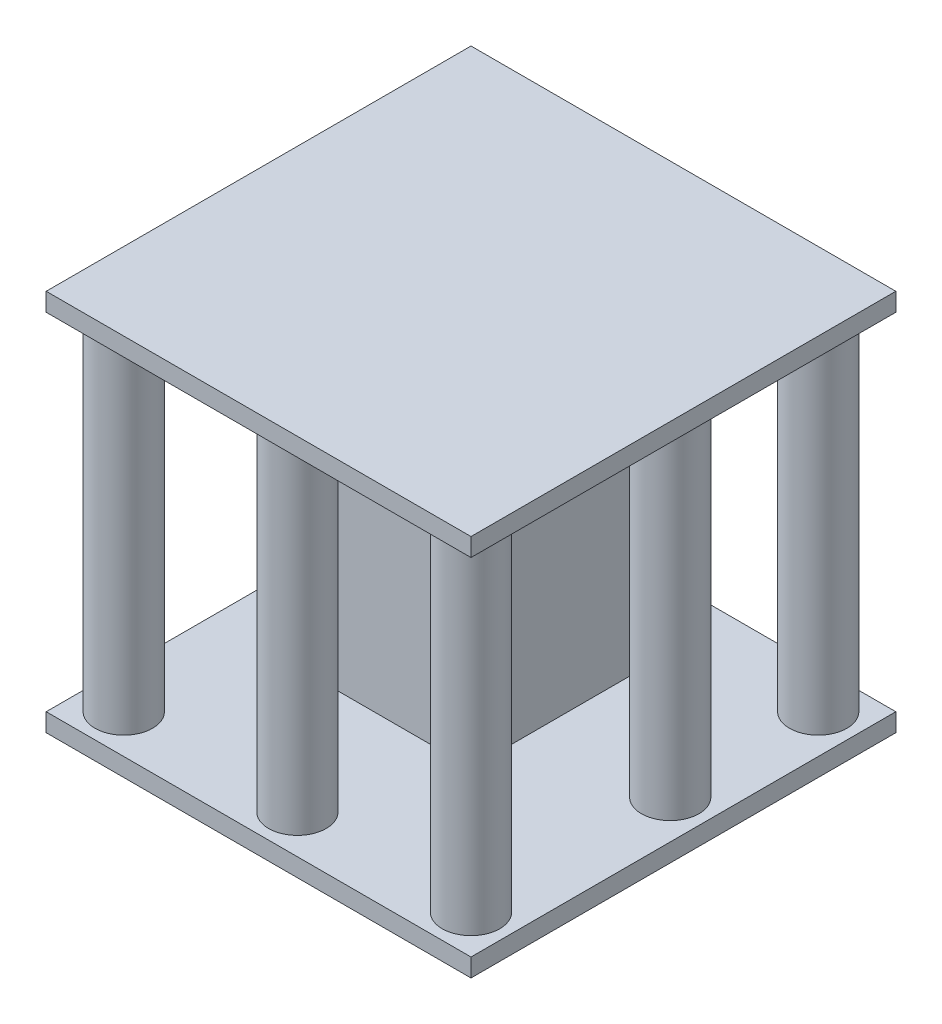
ISO-10303-21;
HEADER;
FILE_DESCRIPTION(('STEP AP214'),'2;1');
FILE_NAME('part.step','',(''),(''),'','','');
FILE_SCHEMA(('AUTOMOTIVE_DESIGN { 1 0 10303 214 1 1 1 1 }'));
ENDSEC;
DATA;
#1=APPLICATION_CONTEXT('core data for automotive mechanical design processes');
#2=APPLICATION_PROTOCOL_DEFINITION('international standard','automotive_design',2000,#1);
#3=PRODUCT_CONTEXT('',#1,'mechanical');
#4=PRODUCT('Part','Part','',(#3));
#5=PRODUCT_RELATED_PRODUCT_CATEGORY('part','',(#4));
#6=PRODUCT_DEFINITION_FORMATION('','',#4);
#7=PRODUCT_DEFINITION_CONTEXT('part definition',#1,'design');
#8=PRODUCT_DEFINITION('design','',#6,#7);
#9=PRODUCT_DEFINITION_SHAPE('','',#8);
#10=(LENGTH_UNIT() NAMED_UNIT(*) SI_UNIT(.MILLI.,.METRE.));
#11=(NAMED_UNIT(*) PLANE_ANGLE_UNIT() SI_UNIT($,.RADIAN.));
#12=(NAMED_UNIT(*) SI_UNIT($,.STERADIAN.) SOLID_ANGLE_UNIT());
#13=UNCERTAINTY_MEASURE_WITH_UNIT(LENGTH_MEASURE(1.E-05),#10,'distance_accuracy_value','');
#14=(GEOMETRIC_REPRESENTATION_CONTEXT(3) GLOBAL_UNCERTAINTY_ASSIGNED_CONTEXT((#13)) GLOBAL_UNIT_ASSIGNED_CONTEXT((#10,
#11,#12)) REPRESENTATION_CONTEXT('',''));
#15=CARTESIAN_POINT('',(0.,0.,0.));
#16=DIRECTION('',(0.,0.,1.));
#17=DIRECTION('',(1.,0.,0.));
#18=AXIS2_PLACEMENT_3D('',#15,#16,#17);
#19=CARTESIAN_POINT('',(-7.5,5.,7.5));
#20=DIRECTION('',(-1.,0.,0.));
#21=DIRECTION('',(0.,0.,1.));
#22=AXIS2_PLACEMENT_3D('',#19,#20,#21);
#23=PLANE('',#22);
#24=DIRECTION('',(0.,1.,0.));
#25=VECTOR('',#24,1.);
#26=CARTESIAN_POINT('',(-7.5,5.,7.5));
#27=LINE('',#26,#25);
#28=CARTESIAN_POINT('',(-7.5,5.,7.5));
#29=VERTEX_POINT('',#28);
#30=CARTESIAN_POINT('',(-7.5,21.,7.5));
#31=VERTEX_POINT('',#30);
#32=EDGE_CURVE('E45',#29,#31,#27,.T.);
#33=ORIENTED_EDGE('',*,*,#32,.T.);
#34=DIRECTION('',(0.,0.,1.));
#35=VECTOR('',#34,1.);
#36=CARTESIAN_POINT('',(-7.5,21.,7.5));
#37=LINE('',#36,#35);
#38=CARTESIAN_POINT('',(-7.5,21.,-7.5));
#39=VERTEX_POINT('',#38);
#40=EDGE_CURVE('E82',#39,#31,#37,.T.);
#41=ORIENTED_EDGE('',*,*,#40,.F.);
#42=DIRECTION('',(0.,1.,0.));
#43=VECTOR('',#42,1.);
#44=CARTESIAN_POINT('',(-7.5,5.,-7.5));
#45=LINE('',#44,#43);
#46=CARTESIAN_POINT('',(-7.5,5.,-7.5));
#47=VERTEX_POINT('',#46);
#48=EDGE_CURVE('E12',#47,#39,#45,.T.);
#49=ORIENTED_EDGE('',*,*,#48,.F.);
#50=DIRECTION('',(0.,0.,1.));
#51=VECTOR('',#50,1.);
#52=CARTESIAN_POINT('',(-7.5,5.,7.5));
#53=LINE('',#52,#51);
#54=EDGE_CURVE('E83',#47,#29,#53,.T.);
#55=ORIENTED_EDGE('',*,*,#54,.T.);
#56=EDGE_LOOP('',(#33,#41,#49,#55));
#57=FACE_BOUND('',#56,.T.);
#58=ADVANCED_FACE('F42',(#57),#23,.T.);
#59=CARTESIAN_POINT('',(7.5,5.,-7.5));
#60=DIRECTION('',(0.,0.,-1.));
#61=DIRECTION('',(-1.,0.,0.));
#62=AXIS2_PLACEMENT_3D('',#59,#60,#61);
#63=PLANE('',#62);
#64=ORIENTED_EDGE('',*,*,#48,.T.);
#65=DIRECTION('',(-1.,0.,0.));
#66=VECTOR('',#65,1.);
#67=CARTESIAN_POINT('',(7.5,21.,-7.5));
#68=LINE('',#67,#66);
#69=CARTESIAN_POINT('',(7.5,21.,-7.5));
#70=VERTEX_POINT('',#69);
#71=EDGE_CURVE('E99',#70,#39,#68,.T.);
#72=ORIENTED_EDGE('',*,*,#71,.F.);
#73=DIRECTION('',(0.,1.,0.));
#74=VECTOR('',#73,1.);
#75=CARTESIAN_POINT('',(7.5,5.,-7.5));
#76=LINE('',#75,#74);
#77=CARTESIAN_POINT('',(7.5,5.,-7.5));
#78=VERTEX_POINT('',#77);
#79=EDGE_CURVE('E50',#78,#70,#76,.T.);
#80=ORIENTED_EDGE('',*,*,#79,.F.);
#81=DIRECTION('',(-1.,0.,0.));
#82=VECTOR('',#81,1.);
#83=CARTESIAN_POINT('',(7.5,5.,-7.5));
#84=LINE('',#83,#82);
#85=EDGE_CURVE('E88',#78,#47,#84,.T.);
#86=ORIENTED_EDGE('',*,*,#85,.T.);
#87=EDGE_LOOP('',(#64,#72,#80,#86));
#88=FACE_BOUND('',#87,.T.);
#89=ADVANCED_FACE('F114',(#88),#63,.T.);
#90=CARTESIAN_POINT('',(7.5,5.,7.5));
#91=DIRECTION('',(1.,0.,0.));
#92=DIRECTION('',(0.,0.,-1.));
#93=AXIS2_PLACEMENT_3D('',#90,#91,#92);
#94=PLANE('',#93);
#95=ORIENTED_EDGE('',*,*,#79,.T.);
#96=DIRECTION('',(0.,0.,-1.));
#97=VECTOR('',#96,1.);
#98=CARTESIAN_POINT('',(7.5,21.,7.5));
#99=LINE('',#98,#97);
#100=CARTESIAN_POINT('',(7.5,21.,7.5));
#101=VERTEX_POINT('',#100);
#102=EDGE_CURVE('E95',#101,#70,#99,.T.);
#103=ORIENTED_EDGE('',*,*,#102,.F.);
#104=DIRECTION('',(0.,1.,0.));
#105=VECTOR('',#104,1.);
#106=CARTESIAN_POINT('',(7.5,5.,7.5));
#107=LINE('',#106,#105);
#108=CARTESIAN_POINT('',(7.5,5.,7.5));
#109=VERTEX_POINT('',#108);
#110=EDGE_CURVE('E87',#109,#101,#107,.T.);
#111=ORIENTED_EDGE('',*,*,#110,.F.);
#112=DIRECTION('',(0.,0.,-1.));
#113=VECTOR('',#112,1.);
#114=CARTESIAN_POINT('',(7.5,5.,7.5));
#115=LINE('',#114,#113);
#116=EDGE_CURVE('E107',#109,#78,#115,.T.);
#117=ORIENTED_EDGE('',*,*,#116,.T.);
#118=EDGE_LOOP('',(#95,#103,#111,#117));
#119=FACE_BOUND('',#118,.T.);
#120=ADVANCED_FACE('F111',(#119),#94,.T.);
#121=CARTESIAN_POINT('',(7.5,5.,7.5));
#122=DIRECTION('',(0.,0.,1.));
#123=DIRECTION('',(1.,0.,0.));
#124=AXIS2_PLACEMENT_3D('',#121,#122,#123);
#125=PLANE('',#124);
#126=ORIENTED_EDGE('',*,*,#110,.T.);
#127=DIRECTION('',(1.,0.,0.));
#128=VECTOR('',#127,1.);
#129=CARTESIAN_POINT('',(7.5,21.,7.5));
#130=LINE('',#129,#128);
#131=EDGE_CURVE('E90',#31,#101,#130,.T.);
#132=ORIENTED_EDGE('',*,*,#131,.F.);
#133=ORIENTED_EDGE('',*,*,#32,.F.);
#134=DIRECTION('',(1.,0.,0.));
#135=VECTOR('',#134,1.);
#136=CARTESIAN_POINT('',(7.5,5.,7.5));
#137=LINE('',#136,#135);
#138=EDGE_CURVE('E105',#29,#109,#137,.T.);
#139=ORIENTED_EDGE('',*,*,#138,.T.);
#140=EDGE_LOOP('',(#126,#132,#133,#139));
#141=FACE_BOUND('',#140,.T.);
#142=ADVANCED_FACE('F91',(#141),#125,.T.);
#143=CARTESIAN_POINT('',(0.,5.,0.));
#144=DIRECTION('',(0.,1.,0.));
#145=DIRECTION('',(0.,0.,1.));
#146=AXIS2_PLACEMENT_3D('',#143,#144,#145);
#147=PLANE('',#146);
#148=ORIENTED_EDGE('',*,*,#54,.F.);
#149=ORIENTED_EDGE('',*,*,#85,.F.);
#150=ORIENTED_EDGE('',*,*,#116,.F.);
#151=ORIENTED_EDGE('',*,*,#138,.F.);
#152=EDGE_LOOP('',(#148,#149,#150,#151));
#153=FACE_BOUND('',#152,.T.);
#154=ADVANCED_FACE('F116',(#153),#147,.F.);
#155=CARTESIAN_POINT('',(0.,21.,0.));
#156=DIRECTION('',(0.,1.,0.));
#157=DIRECTION('',(0.,0.,1.));
#158=AXIS2_PLACEMENT_3D('',#155,#156,#157);
#159=PLANE('',#158);
#160=ORIENTED_EDGE('',*,*,#40,.T.);
#161=ORIENTED_EDGE('',*,*,#131,.T.);
#162=ORIENTED_EDGE('',*,*,#102,.T.);
#163=ORIENTED_EDGE('',*,*,#71,.T.);
#164=EDGE_LOOP('',(#160,#161,#162,#163));
#165=FACE_BOUND('',#164,.T.);
#166=ADVANCED_FACE('F98',(#165),#159,.T.);
#167=CLOSED_SHELL('',(#58,#89,#120,#142,#154,#166));
#168=MANIFOLD_SOLID_BREP('B2',#167);
#169=CARTESIAN_POINT('',(-14.3039923876566,30.,-14.3039923876566));
#170=DIRECTION('',(0.,-1.,0.));
#171=DIRECTION('',(0.,0.,-1.));
#172=AXIS2_PLACEMENT_3D('',#169,#170,#171);
#173=CYLINDRICAL_SURFACE('',#172,2.36959800596441);
#174=CARTESIAN_POINT('',(-14.3039923876566,1.5,-14.3039923876566));
#175=DIRECTION('',(0.,1.,0.));
#176=DIRECTION('',(0.,0.,1.));
#177=AXIS2_PLACEMENT_3D('',#174,#175,#176);
#178=CIRCLE('',#177,2.36959800596441);
#179=CARTESIAN_POINT('',(-14.3039923876566,1.5,-11.9343943816922));
#180=VERTEX_POINT('',#179);
#181=EDGE_CURVE('E168',#180,#180,#178,.T.);
#182=ORIENTED_EDGE('',*,*,#181,.T.);
#183=EDGE_LOOP('',(#182));
#184=FACE_BOUND('',#183,.T.);
#185=CARTESIAN_POINT('',(-14.3039923876566,30.,-14.3039923876566));
#186=DIRECTION('',(0.,1.,0.));
#187=DIRECTION('',(0.,0.,1.));
#188=AXIS2_PLACEMENT_3D('',#185,#186,#187);
#189=CIRCLE('',#188,2.36959800596441);
#190=CARTESIAN_POINT('',(-14.3039923876566,30.,-11.9343943816922));
#191=VERTEX_POINT('',#190);
#192=EDGE_CURVE('E40',#191,#191,#189,.T.);
#193=ORIENTED_EDGE('',*,*,#192,.F.);
#194=EDGE_LOOP('',(#193));
#195=FACE_BOUND('',#194,.T.);
#196=ADVANCED_FACE('F165',(#184,#195),#173,.T.);
#197=CARTESIAN_POINT('',(-17.5,1.5,17.5));
#198=DIRECTION('',(1.,0.,0.));
#199=DIRECTION('',(0.,0.,-1.));
#200=AXIS2_PLACEMENT_3D('',#197,#198,#199);
#201=PLANE('',#200);
#202=DIRECTION('',(0.,0.,1.));
#203=VECTOR('',#202,1.);
#204=CARTESIAN_POINT('',(-17.5,0.,17.5));
#205=LINE('',#204,#203);
#206=CARTESIAN_POINT('',(-17.5,0.,-17.5));
#207=VERTEX_POINT('',#206);
#208=CARTESIAN_POINT('',(-17.5,0.,17.5));
#209=VERTEX_POINT('',#208);
#210=EDGE_CURVE('E312',#207,#209,#205,.T.);
#211=ORIENTED_EDGE('',*,*,#210,.T.);
#212=DIRECTION('',(0.,-1.,0.));
#213=VECTOR('',#212,1.);
#214=CARTESIAN_POINT('',(-17.5,1.5,17.5));
#215=LINE('',#214,#213);
#216=CARTESIAN_POINT('',(-17.5,1.5,17.5));
#217=VERTEX_POINT('',#216);
#218=EDGE_CURVE('E331',#217,#209,#215,.T.);
#219=ORIENTED_EDGE('',*,*,#218,.F.);
#220=DIRECTION('',(0.,0.,1.));
#221=VECTOR('',#220,1.);
#222=CARTESIAN_POINT('',(-17.5,1.5,17.5));
#223=LINE('',#222,#221);
#224=CARTESIAN_POINT('',(-17.5,1.5,-17.5));
#225=VERTEX_POINT('',#224);
#226=EDGE_CURVE('E313',#225,#217,#223,.T.);
#227=ORIENTED_EDGE('',*,*,#226,.F.);
#228=DIRECTION('',(0.,-1.,0.));
#229=VECTOR('',#228,1.);
#230=CARTESIAN_POINT('',(-17.5,1.5,-17.5));
#231=LINE('',#230,#229);
#232=EDGE_CURVE('E319',#225,#207,#231,.T.);
#233=ORIENTED_EDGE('',*,*,#232,.T.);
#234=EDGE_LOOP('',(#211,#219,#227,#233));
#235=FACE_BOUND('',#234,.T.);
#236=ADVANCED_FACE('F346',(#235),#201,.F.);
#237=CARTESIAN_POINT('',(17.5,1.5,17.5));
#238=DIRECTION('',(0.,0.,-1.));
#239=DIRECTION('',(-1.,0.,0.));
#240=AXIS2_PLACEMENT_3D('',#237,#238,#239);
#241=PLANE('',#240);
#242=DIRECTION('',(1.,0.,0.));
#243=VECTOR('',#242,1.);
#244=CARTESIAN_POINT('',(17.5,0.,17.5));
#245=LINE('',#244,#243);
#246=CARTESIAN_POINT('',(17.5,0.,17.5));
#247=VERTEX_POINT('',#246);
#248=EDGE_CURVE('E322',#209,#247,#245,.T.);
#249=ORIENTED_EDGE('',*,*,#248,.T.);
#250=DIRECTION('',(0.,-1.,0.));
#251=VECTOR('',#250,1.);
#252=CARTESIAN_POINT('',(17.5,1.5,17.5));
#253=LINE('',#252,#251);
#254=CARTESIAN_POINT('',(17.5,1.5,17.5));
#255=VERTEX_POINT('',#254);
#256=EDGE_CURVE('E329',#255,#247,#253,.T.);
#257=ORIENTED_EDGE('',*,*,#256,.F.);
#258=DIRECTION('',(1.,0.,0.));
#259=VECTOR('',#258,1.);
#260=CARTESIAN_POINT('',(17.5,1.5,17.5));
#261=LINE('',#260,#259);
#262=EDGE_CURVE('E213',#217,#255,#261,.T.);
#263=ORIENTED_EDGE('',*,*,#262,.F.);
#264=ORIENTED_EDGE('',*,*,#218,.T.);
#265=EDGE_LOOP('',(#249,#257,#263,#264));
#266=FACE_BOUND('',#265,.T.);
#267=ADVANCED_FACE('F349',(#266),#241,.F.);
#268=CARTESIAN_POINT('',(17.5,1.5,17.5));
#269=DIRECTION('',(-1.,0.,0.));
#270=DIRECTION('',(0.,0.,1.));
#271=AXIS2_PLACEMENT_3D('',#268,#269,#270);
#272=PLANE('',#271);
#273=DIRECTION('',(0.,0.,-1.));
#274=VECTOR('',#273,1.);
#275=CARTESIAN_POINT('',(17.5,0.,17.5));
#276=LINE('',#275,#274);
#277=CARTESIAN_POINT('',(17.5,0.,-17.5));
#278=VERTEX_POINT('',#277);
#279=EDGE_CURVE('E199',#247,#278,#276,.T.);
#280=ORIENTED_EDGE('',*,*,#279,.T.);
#281=DIRECTION('',(0.,-1.,0.));
#282=VECTOR('',#281,1.);
#283=CARTESIAN_POINT('',(17.5,1.5,-17.5));
#284=LINE('',#283,#282);
#285=CARTESIAN_POINT('',(17.5,1.5,-17.5));
#286=VERTEX_POINT('',#285);
#287=EDGE_CURVE('E327',#286,#278,#284,.T.);
#288=ORIENTED_EDGE('',*,*,#287,.F.);
#289=DIRECTION('',(0.,0.,-1.));
#290=VECTOR('',#289,1.);
#291=CARTESIAN_POINT('',(17.5,1.5,17.5));
#292=LINE('',#291,#290);
#293=EDGE_CURVE('E316',#255,#286,#292,.T.);
#294=ORIENTED_EDGE('',*,*,#293,.F.);
#295=ORIENTED_EDGE('',*,*,#256,.T.);
#296=EDGE_LOOP('',(#280,#288,#294,#295));
#297=FACE_BOUND('',#296,.T.);
#298=ADVANCED_FACE('F351',(#297),#272,.F.);
#299=CARTESIAN_POINT('',(17.5,1.5,-17.5));
#300=DIRECTION('',(0.,0.,1.));
#301=DIRECTION('',(1.,0.,0.));
#302=AXIS2_PLACEMENT_3D('',#299,#300,#301);
#303=PLANE('',#302);
#304=DIRECTION('',(-1.,0.,0.));
#305=VECTOR('',#304,1.);
#306=CARTESIAN_POINT('',(17.5,0.,-17.5));
#307=LINE('',#306,#305);
#308=EDGE_CURVE('E205',#278,#207,#307,.T.);
#309=ORIENTED_EDGE('',*,*,#308,.T.);
#310=ORIENTED_EDGE('',*,*,#232,.F.);
#311=DIRECTION('',(-1.,0.,0.));
#312=VECTOR('',#311,1.);
#313=CARTESIAN_POINT('',(17.5,1.5,-17.5));
#314=LINE('',#313,#312);
#315=EDGE_CURVE('E181',#286,#225,#314,.T.);
#316=ORIENTED_EDGE('',*,*,#315,.F.);
#317=ORIENTED_EDGE('',*,*,#287,.T.);
#318=EDGE_LOOP('',(#309,#310,#316,#317));
#319=FACE_BOUND('',#318,.T.);
#320=ADVANCED_FACE('F341',(#319),#303,.F.);
#321=CARTESIAN_POINT('',(0.,1.5,0.));
#322=DIRECTION('',(0.,1.,0.));
#323=DIRECTION('',(0.,0.,1.));
#324=AXIS2_PLACEMENT_3D('',#321,#322,#323);
#325=PLANE('',#324);
#326=CARTESIAN_POINT('',(0.,1.5,-14.3039923876566));
#327=DIRECTION('',(0.,1.,0.));
#328=DIRECTION('',(0.,0.,1.));
#329=AXIS2_PLACEMENT_3D('',#326,#327,#328);
#330=CIRCLE('',#329,2.36959800596441);
#331=CARTESIAN_POINT('',(0.,1.5,-11.9343943816922));
#332=VERTEX_POINT('',#331);
#333=EDGE_CURVE('E268',#332,#332,#330,.F.);
#334=ORIENTED_EDGE('',*,*,#333,.T.);
#335=EDGE_LOOP('',(#334));
#336=FACE_BOUND('',#335,.T.);
#337=CARTESIAN_POINT('',(14.3039923876566,1.5,-2.11098540813737));
#338=DIRECTION('',(0.,1.,0.));
#339=DIRECTION('',(0.,0.,1.));
#340=AXIS2_PLACEMENT_3D('',#337,#338,#339);
#341=CIRCLE('',#340,2.36959800596441);
#342=CARTESIAN_POINT('',(14.3039923876566,1.5,0.258612597827041));
#343=VERTEX_POINT('',#342);
#344=EDGE_CURVE('E279',#343,#343,#341,.F.);
#345=ORIENTED_EDGE('',*,*,#344,.T.);
#346=EDGE_LOOP('',(#345));
#347=FACE_BOUND('',#346,.T.);
#348=CARTESIAN_POINT('',(0.,1.5,14.3039923876566));
#349=DIRECTION('',(0.,1.,0.));
#350=DIRECTION('',(0.,0.,1.));
#351=AXIS2_PLACEMENT_3D('',#348,#349,#350);
#352=CIRCLE('',#351,2.36959800596441);
#353=CARTESIAN_POINT('',(0.,1.5,16.673590393621));
#354=VERTEX_POINT('',#353);
#355=EDGE_CURVE('E285',#354,#354,#352,.F.);
#356=ORIENTED_EDGE('',*,*,#355,.T.);
#357=EDGE_LOOP('',(#356));
#358=FACE_BOUND('',#357,.T.);
#359=CARTESIAN_POINT('',(-14.3039923876566,1.5,0.));
#360=DIRECTION('',(0.,1.,0.));
#361=DIRECTION('',(0.,0.,1.));
#362=AXIS2_PLACEMENT_3D('',#359,#360,#361);
#363=CIRCLE('',#362,2.36959800596441);
#364=CARTESIAN_POINT('',(-14.3039923876566,1.5,2.36959800596441));
#365=VERTEX_POINT('',#364);
#366=EDGE_CURVE('E291',#365,#365,#363,.F.);
#367=ORIENTED_EDGE('',*,*,#366,.T.);
#368=EDGE_LOOP('',(#367));
#369=FACE_BOUND('',#368,.T.);
#370=CARTESIAN_POINT('',(-14.3039923876566,1.5,14.3039923876566));
#371=DIRECTION('',(0.,1.,0.));
#372=DIRECTION('',(0.,0.,1.));
#373=AXIS2_PLACEMENT_3D('',#370,#371,#372);
#374=CIRCLE('',#373,2.36959800596441);
#375=CARTESIAN_POINT('',(-14.3039923876566,1.5,16.673590393621));
#376=VERTEX_POINT('',#375);
#377=EDGE_CURVE('E297',#376,#376,#374,.F.);
#378=ORIENTED_EDGE('',*,*,#377,.T.);
#379=EDGE_LOOP('',(#378));
#380=FACE_BOUND('',#379,.T.);
#381=CARTESIAN_POINT('',(14.3039923876566,1.5,14.3039923876566));
#382=DIRECTION('',(0.,1.,0.));
#383=DIRECTION('',(0.,0.,1.));
#384=AXIS2_PLACEMENT_3D('',#381,#382,#383);
#385=CIRCLE('',#384,2.36959800596441);
#386=CARTESIAN_POINT('',(14.3039923876566,1.5,16.673590393621));
#387=VERTEX_POINT('',#386);
#388=EDGE_CURVE('E303',#387,#387,#385,.F.);
#389=ORIENTED_EDGE('',*,*,#388,.T.);
#390=EDGE_LOOP('',(#389));
#391=FACE_BOUND('',#390,.T.);
#392=CARTESIAN_POINT('',(14.3039923876566,1.5,-14.3039923876566));
#393=DIRECTION('',(0.,1.,0.));
#394=DIRECTION('',(0.,0.,1.));
#395=AXIS2_PLACEMENT_3D('',#392,#393,#394);
#396=CIRCLE('',#395,2.36959800596441);
#397=CARTESIAN_POINT('',(14.3039923876566,1.5,-11.9343943816922));
#398=VERTEX_POINT('',#397);
#399=EDGE_CURVE('E309',#398,#398,#396,.F.);
#400=ORIENTED_EDGE('',*,*,#399,.T.);
#401=EDGE_LOOP('',(#400));
#402=FACE_BOUND('',#401,.T.);
#403=ORIENTED_EDGE('',*,*,#181,.F.);
#404=EDGE_LOOP('',(#403));
#405=FACE_BOUND('',#404,.T.);
#406=ORIENTED_EDGE('',*,*,#226,.T.);
#407=ORIENTED_EDGE('',*,*,#262,.T.);
#408=ORIENTED_EDGE('',*,*,#293,.T.);
#409=ORIENTED_EDGE('',*,*,#315,.T.);
#410=EDGE_LOOP('',(#406,#407,#408,#409));
#411=FACE_BOUND('',#410,.T.);
#412=ADVANCED_FACE('F338',(#336,#347,#358,#369,#380,#391,#402,#405,#411),#325,.T.);
#413=CARTESIAN_POINT('',(-14.3039923876566,0.,-14.3039923876566));
#414=DIRECTION('',(0.,1.,0.));
#415=DIRECTION('',(0.,0.,1.));
#416=AXIS2_PLACEMENT_3D('',#413,#414,#415);
#417=PLANE('',#416);
#418=ORIENTED_EDGE('',*,*,#210,.F.);
#419=ORIENTED_EDGE('',*,*,#308,.F.);
#420=ORIENTED_EDGE('',*,*,#279,.F.);
#421=ORIENTED_EDGE('',*,*,#248,.F.);
#422=EDGE_LOOP('',(#418,#419,#420,#421));
#423=FACE_BOUND('',#422,.T.);
#424=ADVANCED_FACE('F340',(#423),#417,.F.);
#425=CARTESIAN_POINT('',(14.3039923876566,30.,-14.3039923876566));
#426=DIRECTION('',(0.,-1.,0.));
#427=DIRECTION('',(0.,0.,-1.));
#428=AXIS2_PLACEMENT_3D('',#425,#426,#427);
#429=CYLINDRICAL_SURFACE('',#428,2.36959800596441);
#430=ORIENTED_EDGE('',*,*,#399,.F.);
#431=EDGE_LOOP('',(#430));
#432=FACE_BOUND('',#431,.T.);
#433=CARTESIAN_POINT('',(14.3039923876566,30.,-14.3039923876566));
#434=DIRECTION('',(0.,1.,0.));
#435=DIRECTION('',(0.,0.,1.));
#436=AXIS2_PLACEMENT_3D('',#433,#434,#435);
#437=CIRCLE('',#436,2.36959800596441);
#438=CARTESIAN_POINT('',(14.3039923876566,30.,-11.9343943816922));
#439=VERTEX_POINT('',#438);
#440=EDGE_CURVE('E306',#439,#439,#437,.T.);
#441=ORIENTED_EDGE('',*,*,#440,.F.);
#442=EDGE_LOOP('',(#441));
#443=FACE_BOUND('',#442,.T.);
#444=ADVANCED_FACE('F368',(#432,#443),#429,.T.);
#445=CARTESIAN_POINT('',(14.3039923876566,30.,14.3039923876566));
#446=DIRECTION('',(0.,-1.,0.));
#447=DIRECTION('',(0.,0.,-1.));
#448=AXIS2_PLACEMENT_3D('',#445,#446,#447);
#449=CYLINDRICAL_SURFACE('',#448,2.36959800596441);
#450=ORIENTED_EDGE('',*,*,#388,.F.);
#451=EDGE_LOOP('',(#450));
#452=FACE_BOUND('',#451,.T.);
#453=CARTESIAN_POINT('',(14.3039923876566,30.,14.3039923876566));
#454=DIRECTION('',(0.,1.,0.));
#455=DIRECTION('',(0.,0.,1.));
#456=AXIS2_PLACEMENT_3D('',#453,#454,#455);
#457=CIRCLE('',#456,2.36959800596441);
#458=CARTESIAN_POINT('',(14.3039923876566,30.,16.673590393621));
#459=VERTEX_POINT('',#458);
#460=EDGE_CURVE('E300',#459,#459,#457,.T.);
#461=ORIENTED_EDGE('',*,*,#460,.F.);
#462=EDGE_LOOP('',(#461));
#463=FACE_BOUND('',#462,.T.);
#464=ADVANCED_FACE('F372',(#452,#463),#449,.T.);
#465=CARTESIAN_POINT('',(-14.3039923876566,30.,14.3039923876566));
#466=DIRECTION('',(0.,-1.,0.));
#467=DIRECTION('',(0.,0.,-1.));
#468=AXIS2_PLACEMENT_3D('',#465,#466,#467);
#469=CYLINDRICAL_SURFACE('',#468,2.36959800596441);
#470=ORIENTED_EDGE('',*,*,#377,.F.);
#471=EDGE_LOOP('',(#470));
#472=FACE_BOUND('',#471,.T.);
#473=CARTESIAN_POINT('',(-14.3039923876566,30.,14.3039923876566));
#474=DIRECTION('',(0.,1.,0.));
#475=DIRECTION('',(0.,0.,1.));
#476=AXIS2_PLACEMENT_3D('',#473,#474,#475);
#477=CIRCLE('',#476,2.36959800596441);
#478=CARTESIAN_POINT('',(-14.3039923876566,30.,16.673590393621));
#479=VERTEX_POINT('',#478);
#480=EDGE_CURVE('E294',#479,#479,#477,.T.);
#481=ORIENTED_EDGE('',*,*,#480,.F.);
#482=EDGE_LOOP('',(#481));
#483=FACE_BOUND('',#482,.T.);
#484=ADVANCED_FACE('F378',(#472,#483),#469,.T.);
#485=CARTESIAN_POINT('',(-14.3039923876566,30.,0.));
#486=DIRECTION('',(0.,-1.,0.));
#487=DIRECTION('',(0.,0.,-1.));
#488=AXIS2_PLACEMENT_3D('',#485,#486,#487);
#489=CYLINDRICAL_SURFACE('',#488,2.36959800596441);
#490=ORIENTED_EDGE('',*,*,#366,.F.);
#491=EDGE_LOOP('',(#490));
#492=FACE_BOUND('',#491,.T.);
#493=CARTESIAN_POINT('',(-14.3039923876566,30.,0.));
#494=DIRECTION('',(0.,1.,0.));
#495=DIRECTION('',(0.,0.,1.));
#496=AXIS2_PLACEMENT_3D('',#493,#494,#495);
#497=CIRCLE('',#496,2.36959800596441);
#498=CARTESIAN_POINT('',(-14.3039923876566,30.,2.36959800596441));
#499=VERTEX_POINT('',#498);
#500=EDGE_CURVE('E288',#499,#499,#497,.T.);
#501=ORIENTED_EDGE('',*,*,#500,.F.);
#502=EDGE_LOOP('',(#501));
#503=FACE_BOUND('',#502,.T.);
#504=ADVANCED_FACE('F386',(#492,#503),#489,.T.);
#505=CARTESIAN_POINT('',(0.,30.,14.3039923876566));
#506=DIRECTION('',(0.,-1.,0.));
#507=DIRECTION('',(0.,0.,-1.));
#508=AXIS2_PLACEMENT_3D('',#505,#506,#507);
#509=CYLINDRICAL_SURFACE('',#508,2.36959800596441);
#510=ORIENTED_EDGE('',*,*,#355,.F.);
#511=EDGE_LOOP('',(#510));
#512=FACE_BOUND('',#511,.T.);
#513=CARTESIAN_POINT('',(0.,30.,14.3039923876566));
#514=DIRECTION('',(0.,1.,0.));
#515=DIRECTION('',(0.,0.,1.));
#516=AXIS2_PLACEMENT_3D('',#513,#514,#515);
#517=CIRCLE('',#516,2.36959800596441);
#518=CARTESIAN_POINT('',(0.,30.,16.673590393621));
#519=VERTEX_POINT('',#518);
#520=EDGE_CURVE('E282',#519,#519,#517,.T.);
#521=ORIENTED_EDGE('',*,*,#520,.F.);
#522=EDGE_LOOP('',(#521));
#523=FACE_BOUND('',#522,.T.);
#524=ADVANCED_FACE('F390',(#512,#523),#509,.T.);
#525=CARTESIAN_POINT('',(14.3039923876566,30.,-2.11098540813737));
#526=DIRECTION('',(0.,-1.,0.));
#527=DIRECTION('',(0.,0.,-1.));
#528=AXIS2_PLACEMENT_3D('',#525,#526,#527);
#529=CYLINDRICAL_SURFACE('',#528,2.36959800596441);
#530=ORIENTED_EDGE('',*,*,#344,.F.);
#531=EDGE_LOOP('',(#530));
#532=FACE_BOUND('',#531,.T.);
#533=CARTESIAN_POINT('',(14.3039923876566,30.,-2.11098540813737));
#534=DIRECTION('',(0.,1.,0.));
#535=DIRECTION('',(0.,0.,1.));
#536=AXIS2_PLACEMENT_3D('',#533,#534,#535);
#537=CIRCLE('',#536,2.36959800596441);
#538=CARTESIAN_POINT('',(14.3039923876566,30.,0.258612597827041));
#539=VERTEX_POINT('',#538);
#540=EDGE_CURVE('E276',#539,#539,#537,.T.);
#541=ORIENTED_EDGE('',*,*,#540,.F.);
#542=EDGE_LOOP('',(#541));
#543=FACE_BOUND('',#542,.T.);
#544=ADVANCED_FACE('F394',(#532,#543),#529,.T.);
#545=CARTESIAN_POINT('',(0.,30.,-14.3039923876566));
#546=DIRECTION('',(0.,-1.,0.));
#547=DIRECTION('',(0.,0.,-1.));
#548=AXIS2_PLACEMENT_3D('',#545,#546,#547);
#549=CYLINDRICAL_SURFACE('',#548,2.36959800596441);
#550=ORIENTED_EDGE('',*,*,#333,.F.);
#551=EDGE_LOOP('',(#550));
#552=FACE_BOUND('',#551,.T.);
#553=CARTESIAN_POINT('',(0.,30.,-14.3039923876566));
#554=DIRECTION('',(0.,1.,0.));
#555=DIRECTION('',(0.,0.,1.));
#556=AXIS2_PLACEMENT_3D('',#553,#554,#555);
#557=CIRCLE('',#556,2.36959800596441);
#558=CARTESIAN_POINT('',(0.,30.,-11.9343943816922));
#559=VERTEX_POINT('',#558);
#560=EDGE_CURVE('E265',#559,#559,#557,.T.);
#561=ORIENTED_EDGE('',*,*,#560,.F.);
#562=EDGE_LOOP('',(#561));
#563=FACE_BOUND('',#562,.T.);
#564=ADVANCED_FACE('F398',(#552,#563),#549,.T.);
#565=CARTESIAN_POINT('',(-17.5,31.5,17.5));
#566=DIRECTION('',(1.,0.,0.));
#567=DIRECTION('',(0.,0.,-1.));
#568=AXIS2_PLACEMENT_3D('',#565,#566,#567);
#569=PLANE('',#568);
#570=DIRECTION('',(0.,0.,1.));
#571=VECTOR('',#570,1.);
#572=CARTESIAN_POINT('',(-17.5,30.,17.5));
#573=LINE('',#572,#571);
#574=CARTESIAN_POINT('',(-17.5,30.,-17.5));
#575=VERTEX_POINT('',#574);
#576=CARTESIAN_POINT('',(-17.5,30.,17.5));
#577=VERTEX_POINT('',#576);
#578=EDGE_CURVE('E264',#575,#577,#573,.T.);
#579=ORIENTED_EDGE('',*,*,#578,.T.);
#580=DIRECTION('',(0.,-1.,0.));
#581=VECTOR('',#580,1.);
#582=CARTESIAN_POINT('',(-17.5,31.5,17.5));
#583=LINE('',#582,#581);
#584=CARTESIAN_POINT('',(-17.5,31.5,17.5));
#585=VERTEX_POINT('',#584);
#586=EDGE_CURVE('E244',#585,#577,#583,.T.);
#587=ORIENTED_EDGE('',*,*,#586,.F.);
#588=DIRECTION('',(0.,0.,1.));
#589=VECTOR('',#588,1.);
#590=CARTESIAN_POINT('',(-17.5,31.5,17.5));
#591=LINE('',#590,#589);
#592=CARTESIAN_POINT('',(-17.5,31.5,-17.5));
#593=VERTEX_POINT('',#592);
#594=EDGE_CURVE('E251',#593,#585,#591,.T.);
#595=ORIENTED_EDGE('',*,*,#594,.F.);
#596=DIRECTION('',(0.,-1.,0.));
#597=VECTOR('',#596,1.);
#598=CARTESIAN_POINT('',(-17.5,31.5,-17.5));
#599=LINE('',#598,#597);
#600=EDGE_CURVE('E560',#593,#575,#599,.T.);
#601=ORIENTED_EDGE('',*,*,#600,.T.);
#602=EDGE_LOOP('',(#579,#587,#595,#601));
#603=FACE_BOUND('',#602,.T.);
#604=ADVANCED_FACE('F262',(#603),#569,.F.);
#605=CARTESIAN_POINT('',(17.5,31.5,17.5));
#606=DIRECTION('',(0.,0.,-1.));
#607=DIRECTION('',(-1.,0.,0.));
#608=AXIS2_PLACEMENT_3D('',#605,#606,#607);
#609=PLANE('',#608);
#610=DIRECTION('',(1.,0.,0.));
#611=VECTOR('',#610,1.);
#612=CARTESIAN_POINT('',(17.5,30.,17.5));
#613=LINE('',#612,#611);
#614=CARTESIAN_POINT('',(17.5,30.,17.5));
#615=VERTEX_POINT('',#614);
#616=EDGE_CURVE('E551',#577,#615,#613,.T.);
#617=ORIENTED_EDGE('',*,*,#616,.T.);
#618=DIRECTION('',(0.,-1.,0.));
#619=VECTOR('',#618,1.);
#620=CARTESIAN_POINT('',(17.5,31.5,17.5));
#621=LINE('',#620,#619);
#622=CARTESIAN_POINT('',(17.5,31.5,17.5));
#623=VERTEX_POINT('',#622);
#624=EDGE_CURVE('E247',#623,#615,#621,.T.);
#625=ORIENTED_EDGE('',*,*,#624,.F.);
#626=DIRECTION('',(1.,0.,0.));
#627=VECTOR('',#626,1.);
#628=CARTESIAN_POINT('',(17.5,31.5,17.5));
#629=LINE('',#628,#627);
#630=EDGE_CURVE('E240',#585,#623,#629,.T.);
#631=ORIENTED_EDGE('',*,*,#630,.F.);
#632=ORIENTED_EDGE('',*,*,#586,.T.);
#633=EDGE_LOOP('',(#617,#625,#631,#632));
#634=FACE_BOUND('',#633,.T.);
#635=ADVANCED_FACE('F242',(#634),#609,.F.);
#636=CARTESIAN_POINT('',(17.5,31.5,17.5));
#637=DIRECTION('',(-1.,0.,0.));
#638=DIRECTION('',(0.,0.,1.));
#639=AXIS2_PLACEMENT_3D('',#636,#637,#638);
#640=PLANE('',#639);
#641=DIRECTION('',(0.,0.,-1.));
#642=VECTOR('',#641,1.);
#643=CARTESIAN_POINT('',(17.5,30.,17.5));
#644=LINE('',#643,#642);
#645=CARTESIAN_POINT('',(17.5,30.,-17.5));
#646=VERTEX_POINT('',#645);
#647=EDGE_CURVE('E553',#615,#646,#644,.T.);
#648=ORIENTED_EDGE('',*,*,#647,.T.);
#649=DIRECTION('',(0.,-1.,0.));
#650=VECTOR('',#649,1.);
#651=CARTESIAN_POINT('',(17.5,31.5,-17.5));
#652=LINE('',#651,#650);
#653=CARTESIAN_POINT('',(17.5,31.5,-17.5));
#654=VERTEX_POINT('',#653);
#655=EDGE_CURVE('E270',#654,#646,#652,.T.);
#656=ORIENTED_EDGE('',*,*,#655,.F.);
#657=DIRECTION('',(0.,0.,-1.));
#658=VECTOR('',#657,1.);
#659=CARTESIAN_POINT('',(17.5,31.5,17.5));
#660=LINE('',#659,#658);
#661=EDGE_CURVE('E250',#623,#654,#660,.T.);
#662=ORIENTED_EDGE('',*,*,#661,.F.);
#663=ORIENTED_EDGE('',*,*,#624,.T.);
#664=EDGE_LOOP('',(#648,#656,#662,#663));
#665=FACE_BOUND('',#664,.T.);
#666=ADVANCED_FACE('F407',(#665),#640,.F.);
#667=CARTESIAN_POINT('',(17.5,31.5,-17.5));
#668=DIRECTION('',(0.,0.,1.));
#669=DIRECTION('',(1.,0.,0.));
#670=AXIS2_PLACEMENT_3D('',#667,#668,#669);
#671=PLANE('',#670);
#672=DIRECTION('',(-1.,0.,0.));
#673=VECTOR('',#672,1.);
#674=CARTESIAN_POINT('',(17.5,30.,-17.5));
#675=LINE('',#674,#673);
#676=EDGE_CURVE('E260',#646,#575,#675,.T.);
#677=ORIENTED_EDGE('',*,*,#676,.T.);
#678=ORIENTED_EDGE('',*,*,#600,.F.);
#679=DIRECTION('',(-1.,0.,0.));
#680=VECTOR('',#679,1.);
#681=CARTESIAN_POINT('',(17.5,31.5,-17.5));
#682=LINE('',#681,#680);
#683=EDGE_CURVE('E256',#654,#593,#682,.T.);
#684=ORIENTED_EDGE('',*,*,#683,.F.);
#685=ORIENTED_EDGE('',*,*,#655,.T.);
#686=EDGE_LOOP('',(#677,#678,#684,#685));
#687=FACE_BOUND('',#686,.T.);
#688=ADVANCED_FACE('F410',(#687),#671,.F.);
#689=CARTESIAN_POINT('',(0.,31.5,0.));
#690=DIRECTION('',(0.,1.,0.));
#691=DIRECTION('',(0.,0.,1.));
#692=AXIS2_PLACEMENT_3D('',#689,#690,#691);
#693=PLANE('',#692);
#694=ORIENTED_EDGE('',*,*,#594,.T.);
#695=ORIENTED_EDGE('',*,*,#630,.T.);
#696=ORIENTED_EDGE('',*,*,#661,.T.);
#697=ORIENTED_EDGE('',*,*,#683,.T.);
#698=EDGE_LOOP('',(#694,#695,#696,#697));
#699=FACE_BOUND('',#698,.T.);
#700=ADVANCED_FACE('F254',(#699),#693,.T.);
#701=CARTESIAN_POINT('',(0.,30.,0.));
#702=DIRECTION('',(0.,1.,0.));
#703=DIRECTION('',(0.,0.,1.));
#704=AXIS2_PLACEMENT_3D('',#701,#702,#703);
#705=PLANE('',#704);
#706=ORIENTED_EDGE('',*,*,#192,.T.);
#707=EDGE_LOOP('',(#706));
#708=FACE_BOUND('',#707,.T.);
#709=ORIENTED_EDGE('',*,*,#440,.T.);
#710=EDGE_LOOP('',(#709));
#711=FACE_BOUND('',#710,.T.);
#712=ORIENTED_EDGE('',*,*,#460,.T.);
#713=EDGE_LOOP('',(#712));
#714=FACE_BOUND('',#713,.T.);
#715=ORIENTED_EDGE('',*,*,#480,.T.);
#716=EDGE_LOOP('',(#715));
#717=FACE_BOUND('',#716,.T.);
#718=ORIENTED_EDGE('',*,*,#500,.T.);
#719=EDGE_LOOP('',(#718));
#720=FACE_BOUND('',#719,.T.);
#721=ORIENTED_EDGE('',*,*,#520,.T.);
#722=EDGE_LOOP('',(#721));
#723=FACE_BOUND('',#722,.T.);
#724=ORIENTED_EDGE('',*,*,#540,.T.);
#725=EDGE_LOOP('',(#724));
#726=FACE_BOUND('',#725,.T.);
#727=ORIENTED_EDGE('',*,*,#560,.T.);
#728=EDGE_LOOP('',(#727));
#729=FACE_BOUND('',#728,.T.);
#730=ORIENTED_EDGE('',*,*,#578,.F.);
#731=ORIENTED_EDGE('',*,*,#676,.F.);
#732=ORIENTED_EDGE('',*,*,#647,.F.);
#733=ORIENTED_EDGE('',*,*,#616,.F.);
#734=EDGE_LOOP('',(#730,#731,#732,#733));
#735=FACE_BOUND('',#734,.T.);
#736=ADVANCED_FACE('F415',(#708,#711,#714,#717,#720,#723,#726,#729,#735),#705,.F.);
#737=CLOSED_SHELL('',(#196,#236,#267,#298,#320,#412,#424,#444,#464,#484,#504,#524,#544,#564,
#604,#635,#666,#688,#700,#736));
#738=MANIFOLD_SOLID_BREP('B6',#737);
#739=ADVANCED_BREP_SHAPE_REPRESENTATION('',(#18,#168,#738),#14);
#740=SHAPE_DEFINITION_REPRESENTATION(#9,#739);
ENDSEC;
END-ISO-10303-21;
